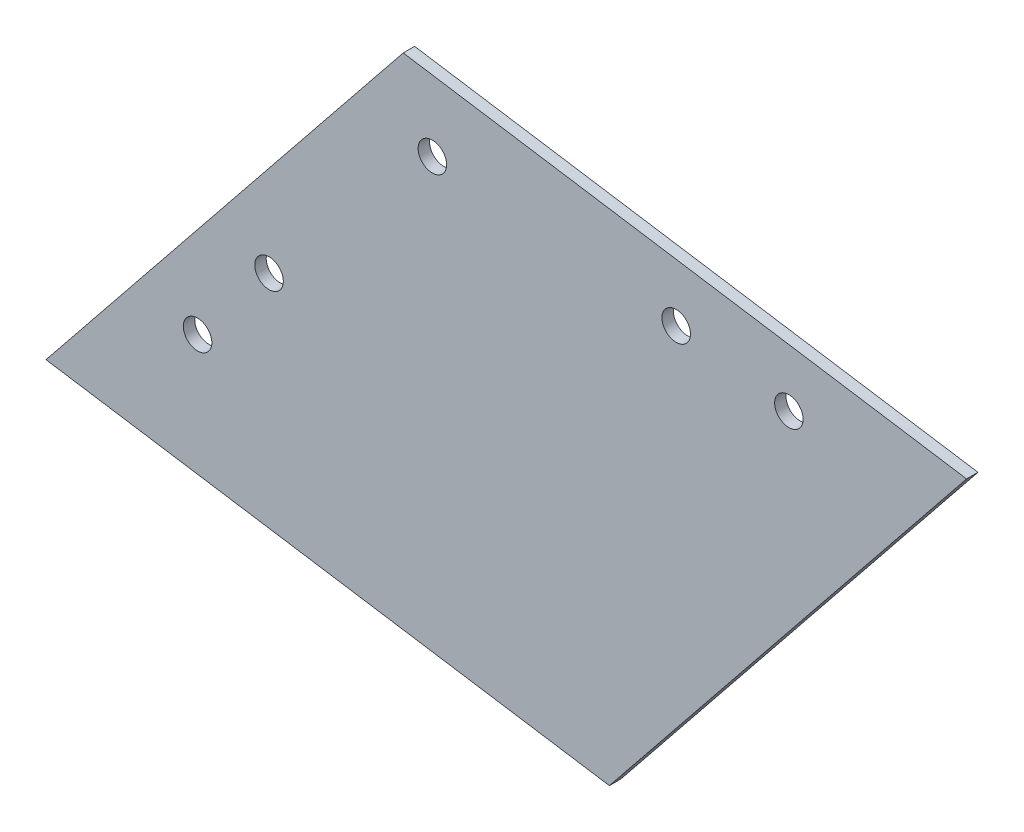
ISO-10303-21;
HEADER;
FILE_DESCRIPTION(('STEP AP214'),'2;1');
FILE_NAME('part.step','',(''),(''),'','','');
FILE_SCHEMA(('AUTOMOTIVE_DESIGN { 1 0 10303 214 1 1 1 1 }'));
ENDSEC;
DATA;
#1=APPLICATION_CONTEXT('core data for automotive mechanical design processes');
#2=APPLICATION_PROTOCOL_DEFINITION('international standard','automotive_design',2000,#1);
#3=PRODUCT_CONTEXT('',#1,'mechanical');
#4=PRODUCT('Part','Part','',(#3));
#5=PRODUCT_RELATED_PRODUCT_CATEGORY('part','',(#4));
#6=PRODUCT_DEFINITION_FORMATION('','',#4);
#7=PRODUCT_DEFINITION_CONTEXT('part definition',#1,'design');
#8=PRODUCT_DEFINITION('design','',#6,#7);
#9=PRODUCT_DEFINITION_SHAPE('','',#8);
#10=(LENGTH_UNIT() NAMED_UNIT(*) SI_UNIT(.MILLI.,.METRE.));
#11=(NAMED_UNIT(*) PLANE_ANGLE_UNIT() SI_UNIT($,.RADIAN.));
#12=(NAMED_UNIT(*) SI_UNIT($,.STERADIAN.) SOLID_ANGLE_UNIT());
#13=UNCERTAINTY_MEASURE_WITH_UNIT(LENGTH_MEASURE(1.E-05),#10,'distance_accuracy_value','');
#14=(GEOMETRIC_REPRESENTATION_CONTEXT(3) GLOBAL_UNCERTAINTY_ASSIGNED_CONTEXT((#13)) GLOBAL_UNIT_ASSIGNED_CONTEXT((#10,
#11,#12)) REPRESENTATION_CONTEXT('',''));
#15=CARTESIAN_POINT('',(0.,0.,0.));
#16=DIRECTION('',(0.,0.,1.));
#17=DIRECTION('',(1.,0.,0.));
#18=AXIS2_PLACEMENT_3D('',#15,#16,#17);
#19=CARTESIAN_POINT('',(0.,0.,2.));
#20=DIRECTION('',(0.153016209024444,0.988223679019982,0.));
#21=DIRECTION('',(-0.988223679019982,0.153016209024444,0.));
#22=AXIS2_PLACEMENT_3D('',#19,#20,#21);
#23=PLANE('',#22);
#24=DIRECTION('',(0.988223679019982,-0.153016209024444,0.));
#25=VECTOR('',#24,1.);
#26=CARTESIAN_POINT('',(0.,0.,0.));
#27=LINE('',#26,#25);
#28=CARTESIAN_POINT('',(0.,0.,0.));
#29=VERTEX_POINT('',#28);
#30=CARTESIAN_POINT('',(98.8223679019982,-15.3016209024444,0.));
#31=VERTEX_POINT('',#30);
#32=EDGE_CURVE('E95',#29,#31,#27,.T.);
#33=ORIENTED_EDGE('',*,*,#32,.T.);
#34=DIRECTION('',(0.,0.,-1.));
#35=VECTOR('',#34,1.);
#36=CARTESIAN_POINT('',(98.8223679019982,-15.3016209024444,2.));
#37=LINE('',#36,#35);
#38=CARTESIAN_POINT('',(98.8223679019982,-15.3016209024444,2.));
#39=VERTEX_POINT('',#38);
#40=EDGE_CURVE('E11',#39,#31,#37,.T.);
#41=ORIENTED_EDGE('',*,*,#40,.F.);
#42=DIRECTION('',(0.988223679019982,-0.153016209024444,0.));
#43=VECTOR('',#42,1.);
#44=CARTESIAN_POINT('',(0.,0.,2.));
#45=LINE('',#44,#43);
#46=CARTESIAN_POINT('',(0.,0.,2.));
#47=VERTEX_POINT('',#46);
#48=EDGE_CURVE('E83',#47,#39,#45,.T.);
#49=ORIENTED_EDGE('',*,*,#48,.F.);
#50=DIRECTION('',(0.,0.,-1.));
#51=VECTOR('',#50,1.);
#52=CARTESIAN_POINT('',(0.,0.,2.));
#53=LINE('',#52,#51);
#54=EDGE_CURVE('E91',#47,#29,#53,.T.);
#55=ORIENTED_EDGE('',*,*,#54,.T.);
#56=EDGE_LOOP('',(#33,#41,#49,#55));
#57=FACE_BOUND('',#56,.T.);
#58=ADVANCED_FACE('F32',(#57),#23,.F.);
#59=CARTESIAN_POINT('',(161.485144273593,62.6302497115959,2.));
#60=DIRECTION('',(-0.779318706140403,0.626627763715947,0.));
#61=DIRECTION('',(-0.626627763715947,-0.779318706140403,0.));
#62=AXIS2_PLACEMENT_3D('',#59,#60,#61);
#63=PLANE('',#62);
#64=DIRECTION('',(0.626627763715947,0.779318706140403,0.));
#65=VECTOR('',#64,1.);
#66=CARTESIAN_POINT('',(161.485144273593,62.6302497115959,0.));
#67=LINE('',#66,#65);
#68=CARTESIAN_POINT('',(161.485144273593,62.6302497115959,0.));
#69=VERTEX_POINT('',#68);
#70=EDGE_CURVE('E87',#31,#69,#67,.T.);
#71=ORIENTED_EDGE('',*,*,#70,.T.);
#72=DIRECTION('',(0.,0.,-1.));
#73=VECTOR('',#72,1.);
#74=CARTESIAN_POINT('',(161.485144273593,62.6302497115959,2.));
#75=LINE('',#74,#73);
#76=CARTESIAN_POINT('',(161.485144273593,62.6302497115959,2.));
#77=VERTEX_POINT('',#76);
#78=EDGE_CURVE('E40',#77,#69,#75,.T.);
#79=ORIENTED_EDGE('',*,*,#78,.F.);
#80=DIRECTION('',(0.626627763715947,0.779318706140403,0.));
#81=VECTOR('',#80,1.);
#82=CARTESIAN_POINT('',(161.485144273593,62.6302497115959,2.));
#83=LINE('',#82,#81);
#84=EDGE_CURVE('E78',#39,#77,#83,.T.);
#85=ORIENTED_EDGE('',*,*,#84,.F.);
#86=ORIENTED_EDGE('',*,*,#40,.T.);
#87=EDGE_LOOP('',(#71,#79,#85,#86));
#88=FACE_BOUND('',#87,.T.);
#89=ADVANCED_FACE('F86',(#88),#63,.F.);
#90=CARTESIAN_POINT('',(62.6627763715947,77.9318706140403,2.));
#91=DIRECTION('',(-0.153016209024444,-0.988223679019982,0.));
#92=DIRECTION('',(0.988223679019982,-0.153016209024444,0.));
#93=AXIS2_PLACEMENT_3D('',#90,#91,#92);
#94=PLANE('',#93);
#95=DIRECTION('',(-0.988223679019982,0.153016209024444,0.));
#96=VECTOR('',#95,1.);
#97=CARTESIAN_POINT('',(62.6627763715947,77.9318706140403,0.));
#98=LINE('',#97,#96);
#99=CARTESIAN_POINT('',(62.6627763715947,77.9318706140403,0.));
#100=VERTEX_POINT('',#99);
#101=EDGE_CURVE('E65',#69,#100,#98,.T.);
#102=ORIENTED_EDGE('',*,*,#101,.T.);
#103=DIRECTION('',(0.,0.,-1.));
#104=VECTOR('',#103,1.);
#105=CARTESIAN_POINT('',(62.6627763715947,77.9318706140403,2.));
#106=LINE('',#105,#104);
#107=CARTESIAN_POINT('',(62.6627763715947,77.9318706140403,2.));
#108=VERTEX_POINT('',#107);
#109=EDGE_CURVE('E88',#108,#100,#106,.T.);
#110=ORIENTED_EDGE('',*,*,#109,.F.);
#111=DIRECTION('',(-0.988223679019982,0.153016209024444,0.));
#112=VECTOR('',#111,1.);
#113=CARTESIAN_POINT('',(62.6627763715947,77.9318706140403,2.));
#114=LINE('',#113,#112);
#115=EDGE_CURVE('E81',#77,#108,#114,.T.);
#116=ORIENTED_EDGE('',*,*,#115,.F.);
#117=ORIENTED_EDGE('',*,*,#78,.T.);
#118=EDGE_LOOP('',(#102,#110,#116,#117));
#119=FACE_BOUND('',#118,.T.);
#120=ADVANCED_FACE('F89',(#119),#94,.F.);
#121=CARTESIAN_POINT('',(0.,0.,2.));
#122=DIRECTION('',(0.779318706140403,-0.626627763715947,0.));
#123=DIRECTION('',(0.626627763715947,0.779318706140403,0.));
#124=AXIS2_PLACEMENT_3D('',#121,#122,#123);
#125=PLANE('',#124);
#126=DIRECTION('',(-0.626627763715947,-0.779318706140403,0.));
#127=VECTOR('',#126,1.);
#128=CARTESIAN_POINT('',(0.,0.,0.));
#129=LINE('',#128,#127);
#130=EDGE_CURVE('E71',#100,#29,#129,.T.);
#131=ORIENTED_EDGE('',*,*,#130,.T.);
#132=ORIENTED_EDGE('',*,*,#54,.F.);
#133=DIRECTION('',(-0.626627763715947,-0.779318706140403,0.));
#134=VECTOR('',#133,1.);
#135=CARTESIAN_POINT('',(0.,0.,2.));
#136=LINE('',#135,#134);
#137=EDGE_CURVE('E48',#108,#47,#136,.T.);
#138=ORIENTED_EDGE('',*,*,#137,.F.);
#139=ORIENTED_EDGE('',*,*,#109,.T.);
#140=EDGE_LOOP('',(#131,#132,#138,#139));
#141=FACE_BOUND('',#140,.T.);
#142=ADVANCED_FACE('F103',(#141),#125,.F.);
#143=CARTESIAN_POINT('',(0.,0.,2.));
#144=DIRECTION('',(0.,0.,-1.));
#145=DIRECTION('',(-1.,0.,0.));
#146=AXIS2_PLACEMENT_3D('',#143,#144,#145);
#147=PLANE('',#146);
#148=CARTESIAN_POINT('',(67.7765148382305,64.7466638191646,2.));
#149=DIRECTION('',(0.,0.,-1.));
#150=DIRECTION('',(-1.,0.,0.));
#151=AXIS2_PLACEMENT_3D('',#148,#149,#150);
#152=CIRCLE('',#151,2.5);
#153=CARTESIAN_POINT('',(65.2765148382305,64.7466638191646,2.));
#154=VERTEX_POINT('',#153);
#155=EDGE_CURVE('E132',#154,#154,#152,.T.);
#156=ORIENTED_EDGE('',*,*,#155,.T.);
#157=EDGE_LOOP('',(#156));
#158=FACE_BOUND('',#157,.T.);
#159=CARTESIAN_POINT('',(110.543798232349,60.3988233726183,2.));
#160=DIRECTION('',(0.,0.,-1.));
#161=DIRECTION('',(-1.,0.,0.));
#162=AXIS2_PLACEMENT_3D('',#159,#160,#161);
#163=CIRCLE('',#162,2.50000000000001);
#164=CARTESIAN_POINT('',(108.043798232349,60.3988233726183,2.));
#165=VERTEX_POINT('',#164);
#166=EDGE_CURVE('E126',#165,#165,#163,.T.);
#167=ORIENTED_EDGE('',*,*,#166,.T.);
#168=EDGE_LOOP('',(#167));
#169=FACE_BOUND('',#168,.T.);
#170=CARTESIAN_POINT('',(130.308271812749,57.3384991921294,2.));
#171=DIRECTION('',(0.,0.,-1.));
#172=DIRECTION('',(-1.,0.,0.));
#173=AXIS2_PLACEMENT_3D('',#170,#171,#172);
#174=CIRCLE('',#173,2.5);
#175=CARTESIAN_POINT('',(127.808271812749,57.3384991921294,2.));
#176=VERTEX_POINT('',#175);
#177=EDGE_CURVE('E120',#176,#176,#174,.T.);
#178=ORIENTED_EDGE('',*,*,#177,.T.);
#179=EDGE_LOOP('',(#178));
#180=FACE_BOUND('',#179,.T.);
#181=CARTESIAN_POINT('',(26.5920199728824,17.1132835470526,2.));
#182=DIRECTION('',(0.,0.,-1.));
#183=DIRECTION('',(-1.,0.,0.));
#184=AXIS2_PLACEMENT_3D('',#181,#182,#183);
#185=CIRCLE('',#184,2.5);
#186=CARTESIAN_POINT('',(24.0920199728824,17.1132835470526,2.));
#187=VERTEX_POINT('',#186);
#188=EDGE_CURVE('E114',#187,#187,#185,.T.);
#189=ORIENTED_EDGE('',*,*,#188,.T.);
#190=EDGE_LOOP('',(#189));
#191=FACE_BOUND('',#190,.T.);
#192=CARTESIAN_POINT('',(39.1245752472014,32.6996576698607,2.));
#193=DIRECTION('',(0.,0.,-1.));
#194=DIRECTION('',(-1.,0.,0.));
#195=AXIS2_PLACEMENT_3D('',#192,#193,#194);
#196=CIRCLE('',#195,2.5);
#197=CARTESIAN_POINT('',(36.6245752472014,32.6996576698607,2.));
#198=VERTEX_POINT('',#197);
#199=EDGE_CURVE('E98',#198,#198,#196,.T.);
#200=ORIENTED_EDGE('',*,*,#199,.T.);
#201=EDGE_LOOP('',(#200));
#202=FACE_BOUND('',#201,.T.);
#203=ORIENTED_EDGE('',*,*,#48,.T.);
#204=ORIENTED_EDGE('',*,*,#84,.T.);
#205=ORIENTED_EDGE('',*,*,#115,.T.);
#206=ORIENTED_EDGE('',*,*,#137,.T.);
#207=EDGE_LOOP('',(#203,#204,#205,#206));
#208=FACE_BOUND('',#207,.T.);
#209=ADVANCED_FACE('F79',(#158,#169,#180,#191,#202,#208),#147,.F.);
#210=CARTESIAN_POINT('',(0.,0.,0.));
#211=DIRECTION('',(0.,0.,-1.));
#212=DIRECTION('',(-1.,0.,0.));
#213=AXIS2_PLACEMENT_3D('',#210,#211,#212);
#214=PLANE('',#213);
#215=CARTESIAN_POINT('',(67.7765148382305,64.7466638191646,0.));
#216=DIRECTION('',(0.,0.,-1.));
#217=DIRECTION('',(-1.,0.,0.));
#218=AXIS2_PLACEMENT_3D('',#215,#216,#217);
#219=CIRCLE('',#218,2.5);
#220=CARTESIAN_POINT('',(65.2765148382305,64.7466638191646,0.));
#221=VERTEX_POINT('',#220);
#222=EDGE_CURVE('E135',#221,#221,#219,.T.);
#223=ORIENTED_EDGE('',*,*,#222,.F.);
#224=EDGE_LOOP('',(#223));
#225=FACE_BOUND('',#224,.T.);
#226=CARTESIAN_POINT('',(110.543798232349,60.3988233726183,0.));
#227=DIRECTION('',(0.,0.,-1.));
#228=DIRECTION('',(-1.,0.,0.));
#229=AXIS2_PLACEMENT_3D('',#226,#227,#228);
#230=CIRCLE('',#229,2.50000000000001);
#231=CARTESIAN_POINT('',(108.043798232349,60.3988233726183,0.));
#232=VERTEX_POINT('',#231);
#233=EDGE_CURVE('E129',#232,#232,#230,.T.);
#234=ORIENTED_EDGE('',*,*,#233,.F.);
#235=EDGE_LOOP('',(#234));
#236=FACE_BOUND('',#235,.T.);
#237=CARTESIAN_POINT('',(130.308271812749,57.3384991921294,0.));
#238=DIRECTION('',(0.,0.,-1.));
#239=DIRECTION('',(-1.,0.,0.));
#240=AXIS2_PLACEMENT_3D('',#237,#238,#239);
#241=CIRCLE('',#240,2.5);
#242=CARTESIAN_POINT('',(127.808271812749,57.3384991921294,0.));
#243=VERTEX_POINT('',#242);
#244=EDGE_CURVE('E123',#243,#243,#241,.T.);
#245=ORIENTED_EDGE('',*,*,#244,.F.);
#246=EDGE_LOOP('',(#245));
#247=FACE_BOUND('',#246,.T.);
#248=CARTESIAN_POINT('',(26.5920199728824,17.1132835470526,0.));
#249=DIRECTION('',(0.,0.,-1.));
#250=DIRECTION('',(-1.,0.,0.));
#251=AXIS2_PLACEMENT_3D('',#248,#249,#250);
#252=CIRCLE('',#251,2.5);
#253=CARTESIAN_POINT('',(24.0920199728824,17.1132835470526,0.));
#254=VERTEX_POINT('',#253);
#255=EDGE_CURVE('E117',#254,#254,#252,.T.);
#256=ORIENTED_EDGE('',*,*,#255,.F.);
#257=EDGE_LOOP('',(#256));
#258=FACE_BOUND('',#257,.T.);
#259=CARTESIAN_POINT('',(39.1245752472014,32.6996576698607,0.));
#260=DIRECTION('',(0.,0.,-1.));
#261=DIRECTION('',(-1.,0.,0.));
#262=AXIS2_PLACEMENT_3D('',#259,#260,#261);
#263=CIRCLE('',#262,2.5);
#264=CARTESIAN_POINT('',(36.6245752472014,32.6996576698607,0.));
#265=VERTEX_POINT('',#264);
#266=EDGE_CURVE('E111',#265,#265,#263,.T.);
#267=ORIENTED_EDGE('',*,*,#266,.F.);
#268=EDGE_LOOP('',(#267));
#269=FACE_BOUND('',#268,.T.);
#270=ORIENTED_EDGE('',*,*,#32,.F.);
#271=ORIENTED_EDGE('',*,*,#130,.F.);
#272=ORIENTED_EDGE('',*,*,#101,.F.);
#273=ORIENTED_EDGE('',*,*,#70,.F.);
#274=EDGE_LOOP('',(#270,#271,#272,#273));
#275=FACE_BOUND('',#274,.T.);
#276=ADVANCED_FACE('F106',(#225,#236,#247,#258,#269,#275),#214,.T.);
#277=CARTESIAN_POINT('',(39.1245752472014,32.6996576698607,6.));
#278=DIRECTION('',(0.,0.,-1.));
#279=DIRECTION('',(-1.,0.,0.));
#280=AXIS2_PLACEMENT_3D('',#277,#278,#279);
#281=CYLINDRICAL_SURFACE('',#280,2.5);
#282=ORIENTED_EDGE('',*,*,#266,.T.);
#283=EDGE_LOOP('',(#282));
#284=FACE_BOUND('',#283,.T.);
#285=ORIENTED_EDGE('',*,*,#199,.F.);
#286=EDGE_LOOP('',(#285));
#287=FACE_BOUND('',#286,.T.);
#288=ADVANCED_FACE('F144',(#284,#287),#281,.F.);
#289=CARTESIAN_POINT('',(26.5920199728824,17.1132835470526,6.));
#290=DIRECTION('',(0.,0.,-1.));
#291=DIRECTION('',(-1.,0.,0.));
#292=AXIS2_PLACEMENT_3D('',#289,#290,#291);
#293=CYLINDRICAL_SURFACE('',#292,2.5);
#294=ORIENTED_EDGE('',*,*,#255,.T.);
#295=EDGE_LOOP('',(#294));
#296=FACE_BOUND('',#295,.T.);
#297=ORIENTED_EDGE('',*,*,#188,.F.);
#298=EDGE_LOOP('',(#297));
#299=FACE_BOUND('',#298,.T.);
#300=ADVANCED_FACE('F156',(#296,#299),#293,.F.);
#301=CARTESIAN_POINT('',(130.308271812749,57.3384991921294,6.));
#302=DIRECTION('',(0.,0.,-1.));
#303=DIRECTION('',(-1.,0.,0.));
#304=AXIS2_PLACEMENT_3D('',#301,#302,#303);
#305=CYLINDRICAL_SURFACE('',#304,2.5);
#306=ORIENTED_EDGE('',*,*,#244,.T.);
#307=EDGE_LOOP('',(#306));
#308=FACE_BOUND('',#307,.T.);
#309=ORIENTED_EDGE('',*,*,#177,.F.);
#310=EDGE_LOOP('',(#309));
#311=FACE_BOUND('',#310,.T.);
#312=ADVANCED_FACE('F199',(#308,#311),#305,.F.);
#313=CARTESIAN_POINT('',(110.543798232349,60.3988233726183,6.));
#314=DIRECTION('',(0.,0.,-1.));
#315=DIRECTION('',(-1.,0.,0.));
#316=AXIS2_PLACEMENT_3D('',#313,#314,#315);
#317=CYLINDRICAL_SURFACE('',#316,2.50000000000001);
#318=ORIENTED_EDGE('',*,*,#233,.T.);
#319=EDGE_LOOP('',(#318));
#320=FACE_BOUND('',#319,.T.);
#321=ORIENTED_EDGE('',*,*,#166,.F.);
#322=EDGE_LOOP('',(#321));
#323=FACE_BOUND('',#322,.T.);
#324=ADVANCED_FACE('F209',(#320,#323),#317,.F.);
#325=CARTESIAN_POINT('',(67.7765148382305,64.7466638191646,6.));
#326=DIRECTION('',(0.,0.,-1.));
#327=DIRECTION('',(-1.,0.,0.));
#328=AXIS2_PLACEMENT_3D('',#325,#326,#327);
#329=CYLINDRICAL_SURFACE('',#328,2.5);
#330=ORIENTED_EDGE('',*,*,#222,.T.);
#331=EDGE_LOOP('',(#330));
#332=FACE_BOUND('',#331,.T.);
#333=ORIENTED_EDGE('',*,*,#155,.F.);
#334=EDGE_LOOP('',(#333));
#335=FACE_BOUND('',#334,.T.);
#336=ADVANCED_FACE('F139',(#332,#335),#329,.F.);
#337=CLOSED_SHELL('',(#58,#89,#120,#142,#209,#276,#288,#300,#312,#324,#336));
#338=MANIFOLD_SOLID_BREP('B2',#337);
#339=ADVANCED_BREP_SHAPE_REPRESENTATION('',(#18,#338),#14);
#340=SHAPE_DEFINITION_REPRESENTATION(#9,#339);
ENDSEC;
END-ISO-10303-21;
